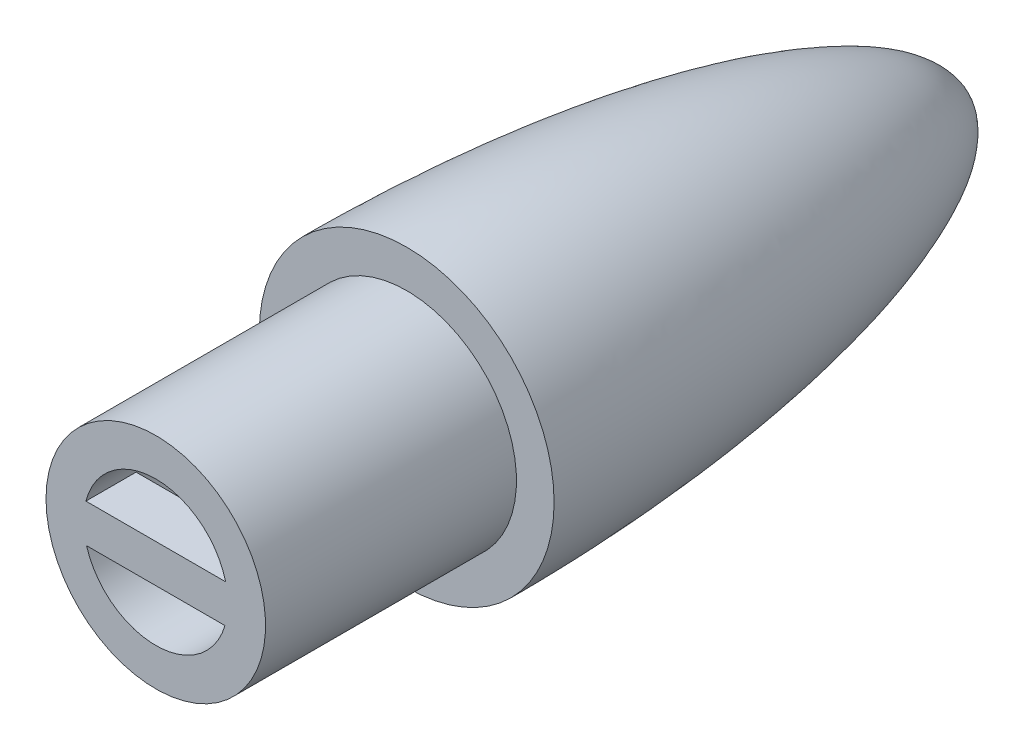
ISO-10303-21;
HEADER;
FILE_DESCRIPTION(('STEP AP214'),'2;1');
FILE_NAME('part.step','',(''),(''),'','','');
FILE_SCHEMA(('AUTOMOTIVE_DESIGN { 1 0 10303 214 1 1 1 1 }'));
ENDSEC;
DATA;
#1=APPLICATION_CONTEXT('core data for automotive mechanical design processes');
#2=APPLICATION_PROTOCOL_DEFINITION('international standard','automotive_design',2000,#1);
#3=PRODUCT_CONTEXT('',#1,'mechanical');
#4=PRODUCT('Part','Part','',(#3));
#5=PRODUCT_RELATED_PRODUCT_CATEGORY('part','',(#4));
#6=PRODUCT_DEFINITION_FORMATION('','',#4);
#7=PRODUCT_DEFINITION_CONTEXT('part definition',#1,'design');
#8=PRODUCT_DEFINITION('design','',#6,#7);
#9=PRODUCT_DEFINITION_SHAPE('','',#8);
#10=(LENGTH_UNIT() NAMED_UNIT(*) SI_UNIT(.MILLI.,.METRE.));
#11=(NAMED_UNIT(*) PLANE_ANGLE_UNIT() SI_UNIT($,.RADIAN.));
#12=(NAMED_UNIT(*) SI_UNIT($,.STERADIAN.) SOLID_ANGLE_UNIT());
#13=UNCERTAINTY_MEASURE_WITH_UNIT(LENGTH_MEASURE(1.E-05),#10,'distance_accuracy_value','');
#14=(GEOMETRIC_REPRESENTATION_CONTEXT(3) GLOBAL_UNCERTAINTY_ASSIGNED_CONTEXT((#13)) GLOBAL_UNIT_ASSIGNED_CONTEXT((#10,
#11,#12)) REPRESENTATION_CONTEXT('',''));
#15=CARTESIAN_POINT('',(0.,0.,0.));
#16=DIRECTION('',(0.,0.,1.));
#17=DIRECTION('',(1.,0.,0.));
#18=AXIS2_PLACEMENT_3D('',#15,#16,#17);
#19=CARTESIAN_POINT('',(0.,0.,-11.4224137931035));
#20=CARTESIAN_POINT('',(-1.27842358805768,0.,-11.4170262447102));
#21=CARTESIAN_POINT('',(-3.8731442444061,0.,-9.55869532675215));
#22=CARTESIAN_POINT('',(-5.9447869689709,0.,-5.62724240177955));
#23=CARTESIAN_POINT('',(-7.71087362541216,0.,-0.90591060847866));
#24=CARTESIAN_POINT('',(-8.88561835909065,0.,3.57028401284876));
#25=CARTESIAN_POINT('',(-9.89139584509542,0.,8.5945616289192));
#26=CARTESIAN_POINT('',(-10.6704832252647,0.,13.7917627413052));
#27=CARTESIAN_POINT('',(-11.21901277394,0.,19.1220090952529));
#28=CARTESIAN_POINT('',(-11.5302376957972,0.,23.7906689026005));
#29=CARTESIAN_POINT('',(-11.7075213881395,0.,28.0932945242523));
#30=CARTESIAN_POINT('',(-11.7499661768627,0.,30.9224469636252));
#31=CARTESIAN_POINT('',(-11.75,0.,32.5775862068965));
#32=B_SPLINE_CURVE_WITH_KNOTS('',3,(#19,#20,#21,#22,#23,#24,#25,#26,#27,#28,#29,#30,#31),
.UNSPECIFIED.,.F.,.F.,(4,1,1,1,1,1,1,1,1,1,4),(0.,0.0770957447788934,0.191082865444481,
0.276022469991274,0.39603374384951,0.482752955144431,0.599802604730606,0.727919368573412,
0.821235279188653,0.895416593572724,1.),.UNSPECIFIED.);
#33=CARTESIAN_POINT('',(0.,0.,-11.4224137931035));
#34=DIRECTION('',(0.,0.,-1.));
#35=AXIS1_PLACEMENT('',#33,#34);
#36=SURFACE_OF_REVOLUTION('',#32,#35);
#37=CARTESIAN_POINT('',(0.,0.,32.5775862068965));
#38=DIRECTION('',(0.,0.,-1.));
#39=DIRECTION('',(-1.,0.,0.));
#40=AXIS2_PLACEMENT_3D('',#37,#38,#39);
#41=CIRCLE('',#40,11.75);
#42=CARTESIAN_POINT('',(-11.75,0.,32.5775862068965));
#43=VERTEX_POINT('',#42);
#44=EDGE_CURVE('E151',#43,#43,#41,.T.);
#45=ORIENTED_EDGE('',*,*,#44,.T.);
#46=EDGE_LOOP('',(#45));
#47=FACE_BOUND('',#46,.T.);
#48=CARTESIAN_POINT('',(0.,0.,-11.4224137931035));
#49=VERTEX_POINT('',#48);
#50=VERTEX_LOOP('',#49);
#51=FACE_BOUND('',#50,.T.);
#52=ADVANCED_FACE('F39',(#47,#51),#36,.F.);
#53=CARTESIAN_POINT('',(0.,0.,1.94358481155403));
#54=DIRECTION('',(0.,0.,1.));
#55=DIRECTION('',(1.,0.,0.));
#56=AXIS2_PLACEMENT_3D('',#53,#54,#55);
#57=CONICAL_SURFACE('',#56,6.03426066556403,0.506929341075671);
#58=CARTESIAN_POINT('',(0.,0.,-8.92241379310346));
#59=VERTEX_POINT('',#58);
#60=VERTEX_LOOP('',#59);
#61=FACE_BOUND('',#60,.T.);
#62=CARTESIAN_POINT('',(0.,0.,1.94358481155403));
#63=DIRECTION('',(0.,0.,-1.));
#64=DIRECTION('',(-1.,0.,0.));
#65=AXIS2_PLACEMENT_3D('',#62,#63,#64);
#66=CIRCLE('',#65,6.03426066556403);
#67=CARTESIAN_POINT('',(-6.03426066556403,0.,1.94358481155403));
#68=VERTEX_POINT('',#67);
#69=EDGE_CURVE('E123',#68,#68,#66,.T.);
#70=ORIENTED_EDGE('',*,*,#69,.F.);
#71=EDGE_LOOP('',(#70));
#72=FACE_BOUND('',#71,.T.);
#73=ADVANCED_FACE('F179',(#61,#72),#57,.F.);
#74=CARTESIAN_POINT('',(0.,0.,29.5775862068965));
#75=DIRECTION('',(0.,0.,1.));
#76=DIRECTION('',(1.,0.,0.));
#77=AXIS2_PLACEMENT_3D('',#74,#75,#76);
#78=CONICAL_SURFACE('',#77,8.74999999999999,0.0979607228679892);
#79=ORIENTED_EDGE('',*,*,#69,.T.);
#80=EDGE_LOOP('',(#79));
#81=FACE_BOUND('',#80,.T.);
#82=CARTESIAN_POINT('',(0.,0.,29.5775862068965));
#83=DIRECTION('',(0.,0.,-1.));
#84=DIRECTION('',(-1.,0.,0.));
#85=AXIS2_PLACEMENT_3D('',#82,#83,#84);
#86=CIRCLE('',#85,8.74999999999999);
#87=CARTESIAN_POINT('',(-8.74999999999999,0.,29.5775862068965));
#88=VERTEX_POINT('',#87);
#89=EDGE_CURVE('E120',#88,#88,#86,.T.);
#90=ORIENTED_EDGE('',*,*,#89,.F.);
#91=EDGE_LOOP('',(#90));
#92=FACE_BOUND('',#91,.T.);
#93=ADVANCED_FACE('F184',(#81,#92),#78,.F.);
#94=CARTESIAN_POINT('',(-5.74999999999999,0.,29.5775862068965));
#95=DIRECTION('',(0.,0.,-1.));
#96=DIRECTION('',(-1.,0.,0.));
#97=AXIS2_PLACEMENT_3D('',#94,#95,#96);
#98=PLANE('',#97);
#99=ORIENTED_EDGE('',*,*,#89,.T.);
#100=EDGE_LOOP('',(#99));
#101=FACE_BOUND('',#100,.T.);
#102=CARTESIAN_POINT('',(0.,0.,29.5775862068965));
#103=DIRECTION('',(0.,0.,-1.));
#104=DIRECTION('',(-1.,0.,0.));
#105=AXIS2_PLACEMENT_3D('',#102,#103,#104);
#106=CIRCLE('',#105,5.74999999999999);
#107=CARTESIAN_POINT('',(-5.74999999999999,0.,29.5775862068965));
#108=VERTEX_POINT('',#107);
#109=EDGE_CURVE('E111',#108,#108,#106,.T.);
#110=ORIENTED_EDGE('',*,*,#109,.F.);
#111=EDGE_LOOP('',(#110));
#112=FACE_BOUND('',#111,.T.);
#113=ADVANCED_FACE('F191',(#101,#112),#98,.T.);
#114=CARTESIAN_POINT('',(0.,0.,-11.4224137931035));
#115=DIRECTION('',(0.,0.,-1.));
#116=DIRECTION('',(-1.,0.,0.));
#117=AXIS2_PLACEMENT_3D('',#114,#115,#116);
#118=CYLINDRICAL_SURFACE('',#117,5.74999999999999);
#119=DIRECTION('',(0.,0.,-1.));
#120=VECTOR('',#119,1.);
#121=CARTESIAN_POINT('',(-5.56936988927004,1.42990175763656,-11.4224137931035));
#122=LINE('',#121,#120);
#123=CARTESIAN_POINT('',(-5.56936988927004,1.42990175763656,48.5775862068965));
#124=VERTEX_POINT('',#123);
#125=CARTESIAN_POINT('',(-5.56936988927004,1.42990175763656,52.5775862068965));
#126=VERTEX_POINT('',#125);
#127=EDGE_CURVE('E101',#124,#126,#122,.F.);
#128=ORIENTED_EDGE('',*,*,#127,.F.);
#129=CARTESIAN_POINT('',(0.,0.,48.5775862068965));
#130=DIRECTION('',(0.,0.,1.));
#131=DIRECTION('',(1.,0.,0.));
#132=AXIS2_PLACEMENT_3D('',#129,#130,#131);
#133=CIRCLE('',#132,5.74999999999999);
#134=CARTESIAN_POINT('',(-5.51752539460574,-1.61846023117057,48.5775862068965));
#135=VERTEX_POINT('',#134);
#136=EDGE_CURVE('E11',#124,#135,#133,.T.);
#137=ORIENTED_EDGE('',*,*,#136,.T.);
#138=DIRECTION('',(0.,0.,-1.));
#139=VECTOR('',#138,1.);
#140=CARTESIAN_POINT('',(-5.51752539460574,-1.61846023117057,-11.4224137931035));
#141=LINE('',#140,#139);
#142=CARTESIAN_POINT('',(-5.51752539460574,-1.61846023117057,52.5775862068965));
#143=VERTEX_POINT('',#142);
#144=EDGE_CURVE('E88',#143,#135,#141,.T.);
#145=ORIENTED_EDGE('',*,*,#144,.F.);
#146=CARTESIAN_POINT('',(0.,0.,52.5775862068965));
#147=DIRECTION('',(0.,0.,-1.));
#148=DIRECTION('',(-1.,0.,0.));
#149=AXIS2_PLACEMENT_3D('',#146,#147,#148);
#150=CIRCLE('',#149,5.74999999999999);
#151=CARTESIAN_POINT('',(5.51752539460574,-1.61846023117057,52.5775862068965));
#152=VERTEX_POINT('',#151);
#153=EDGE_CURVE('E99',#152,#143,#150,.T.);
#154=ORIENTED_EDGE('',*,*,#153,.F.);
#155=DIRECTION('',(0.,0.,-1.));
#156=VECTOR('',#155,1.);
#157=CARTESIAN_POINT('',(5.51752539460574,-1.61846023117057,-11.4224137931035));
#158=LINE('',#157,#156);
#159=CARTESIAN_POINT('',(5.51752539460574,-1.61846023117057,48.5775862068965));
#160=VERTEX_POINT('',#159);
#161=EDGE_CURVE('E91',#160,#152,#158,.F.);
#162=ORIENTED_EDGE('',*,*,#161,.F.);
#163=CARTESIAN_POINT('',(5.56936988927004,1.42990175763656,48.5775862068965));
#164=VERTEX_POINT('',#163);
#165=EDGE_CURVE('E43',#160,#164,#133,.T.);
#166=ORIENTED_EDGE('',*,*,#165,.T.);
#167=DIRECTION('',(0.,0.,-1.));
#168=VECTOR('',#167,1.);
#169=CARTESIAN_POINT('',(5.56936988927004,1.42990175763656,-11.4224137931035));
#170=LINE('',#169,#168);
#171=CARTESIAN_POINT('',(5.56936988927004,1.42990175763656,52.5775862068965));
#172=VERTEX_POINT('',#171);
#173=EDGE_CURVE('E132',#172,#164,#170,.T.);
#174=ORIENTED_EDGE('',*,*,#173,.F.);
#175=EDGE_CURVE('E106',#126,#172,#150,.T.);
#176=ORIENTED_EDGE('',*,*,#175,.F.);
#177=EDGE_LOOP('',(#128,#137,#145,#154,#162,#166,#174,#176));
#178=FACE_BOUND('',#177,.T.);
#179=ORIENTED_EDGE('',*,*,#109,.T.);
#180=EDGE_LOOP('',(#179));
#181=FACE_BOUND('',#180,.T.);
#182=ADVANCED_FACE('F97',(#178,#181),#118,.F.);
#183=CARTESIAN_POINT('',(-8.74999999999999,0.,52.5775862068965));
#184=DIRECTION('',(0.,0.,1.));
#185=DIRECTION('',(1.,0.,0.));
#186=AXIS2_PLACEMENT_3D('',#183,#184,#185);
#187=PLANE('',#186);
#188=DIRECTION('',(-1.,0.,0.));
#189=VECTOR('',#188,1.);
#190=CARTESIAN_POINT('',(-6.53669374919466,1.42990175763656,52.5775862068965));
#191=LINE('',#190,#189);
#192=EDGE_CURVE('E61',#172,#126,#191,.T.);
#193=ORIENTED_EDGE('',*,*,#192,.T.);
#194=ORIENTED_EDGE('',*,*,#175,.T.);
#195=EDGE_LOOP('',(#193,#194));
#196=FACE_BOUND('',#195,.T.);
#197=ORIENTED_EDGE('',*,*,#153,.T.);
#198=DIRECTION('',(1.,0.,0.));
#199=VECTOR('',#198,1.);
#200=CARTESIAN_POINT('',(-6.53669374919466,-1.61846023117057,52.5775862068965));
#201=LINE('',#200,#199);
#202=EDGE_CURVE('E54',#143,#152,#201,.T.);
#203=ORIENTED_EDGE('',*,*,#202,.T.);
#204=EDGE_LOOP('',(#197,#203));
#205=FACE_BOUND('',#204,.T.);
#206=CARTESIAN_POINT('',(0.,0.,52.5775862068965));
#207=DIRECTION('',(0.,0.,-1.));
#208=DIRECTION('',(-1.,0.,0.));
#209=AXIS2_PLACEMENT_3D('',#206,#207,#208);
#210=CIRCLE('',#209,8.74999999999999);
#211=CARTESIAN_POINT('',(-8.74999999999999,0.,52.5775862068965));
#212=VERTEX_POINT('',#211);
#213=EDGE_CURVE('E107',#212,#212,#210,.T.);
#214=ORIENTED_EDGE('',*,*,#213,.F.);
#215=EDGE_LOOP('',(#214));
#216=FACE_BOUND('',#215,.T.);
#217=ADVANCED_FACE('F103',(#196,#205,#216),#187,.T.);
#218=CARTESIAN_POINT('',(0.,0.,-11.4224137931035));
#219=DIRECTION('',(0.,0.,-1.));
#220=DIRECTION('',(-1.,0.,0.));
#221=AXIS2_PLACEMENT_3D('',#218,#219,#220);
#222=CYLINDRICAL_SURFACE('',#221,8.74999999999999);
#223=ORIENTED_EDGE('',*,*,#213,.T.);
#224=EDGE_LOOP('',(#223));
#225=FACE_BOUND('',#224,.T.);
#226=CARTESIAN_POINT('',(0.,0.,32.5775862068965));
#227=DIRECTION('',(0.,0.,-1.));
#228=DIRECTION('',(-1.,0.,0.));
#229=AXIS2_PLACEMENT_3D('',#226,#227,#228);
#230=CIRCLE('',#229,8.74999999999999);
#231=CARTESIAN_POINT('',(-8.74999999999999,0.,32.5775862068965));
#232=VERTEX_POINT('',#231);
#233=EDGE_CURVE('E113',#232,#232,#230,.T.);
#234=ORIENTED_EDGE('',*,*,#233,.F.);
#235=EDGE_LOOP('',(#234));
#236=FACE_BOUND('',#235,.T.);
#237=ADVANCED_FACE('F168',(#225,#236),#222,.T.);
#238=CARTESIAN_POINT('',(-11.75,0.,32.5775862068965));
#239=DIRECTION('',(0.,0.,1.));
#240=DIRECTION('',(1.,0.,0.));
#241=AXIS2_PLACEMENT_3D('',#238,#239,#240);
#242=PLANE('',#241);
#243=ORIENTED_EDGE('',*,*,#233,.T.);
#244=EDGE_LOOP('',(#243));
#245=FACE_BOUND('',#244,.T.);
#246=ORIENTED_EDGE('',*,*,#44,.F.);
#247=EDGE_LOOP('',(#246));
#248=FACE_BOUND('',#247,.T.);
#249=ADVANCED_FACE('F165',(#245,#248),#242,.T.);
#250=CARTESIAN_POINT('',(0.,0.,48.5775862068965));
#251=DIRECTION('',(0.,0.,1.));
#252=DIRECTION('',(1.,0.,0.));
#253=AXIS2_PLACEMENT_3D('',#250,#251,#252);
#254=PLANE('',#253);
#255=ORIENTED_EDGE('',*,*,#136,.F.);
#256=DIRECTION('',(-1.,0.,0.));
#257=VECTOR('',#256,1.);
#258=CARTESIAN_POINT('',(-6.53669374919466,1.42990175763656,48.5775862068965));
#259=LINE('',#258,#257);
#260=EDGE_CURVE('E138',#164,#124,#259,.T.);
#261=ORIENTED_EDGE('',*,*,#260,.F.);
#262=ORIENTED_EDGE('',*,*,#165,.F.);
#263=DIRECTION('',(1.,0.,0.));
#264=VECTOR('',#263,1.);
#265=CARTESIAN_POINT('',(-6.53669374919466,-1.61846023117057,48.5775862068965));
#266=LINE('',#265,#264);
#267=EDGE_CURVE('E136',#135,#160,#266,.T.);
#268=ORIENTED_EDGE('',*,*,#267,.F.);
#269=EDGE_LOOP('',(#255,#261,#262,#268));
#270=FACE_BOUND('',#269,.T.);
#271=ADVANCED_FACE('F135',(#270),#254,.F.);
#272=CARTESIAN_POINT('',(-6.53669374919466,1.42990175763656,48.5775862068965));
#273=DIRECTION('',(0.,1.,0.));
#274=DIRECTION('',(0.,0.,1.));
#275=AXIS2_PLACEMENT_3D('',#272,#273,#274);
#276=PLANE('',#275);
#277=ORIENTED_EDGE('',*,*,#192,.F.);
#278=ORIENTED_EDGE('',*,*,#173,.T.);
#279=ORIENTED_EDGE('',*,*,#260,.T.);
#280=ORIENTED_EDGE('',*,*,#127,.T.);
#281=EDGE_LOOP('',(#277,#278,#279,#280));
#282=FACE_BOUND('',#281,.T.);
#283=ADVANCED_FACE('F219',(#282),#276,.T.);
#284=CARTESIAN_POINT('',(-6.53669374919466,-1.61846023117057,48.5775862068965));
#285=DIRECTION('',(0.,-1.,0.));
#286=DIRECTION('',(0.,0.,-1.));
#287=AXIS2_PLACEMENT_3D('',#284,#285,#286);
#288=PLANE('',#287);
#289=ORIENTED_EDGE('',*,*,#202,.F.);
#290=ORIENTED_EDGE('',*,*,#144,.T.);
#291=ORIENTED_EDGE('',*,*,#267,.T.);
#292=ORIENTED_EDGE('',*,*,#161,.T.);
#293=EDGE_LOOP('',(#289,#290,#291,#292));
#294=FACE_BOUND('',#293,.T.);
#295=ADVANCED_FACE('F86',(#294),#288,.T.);
#296=CLOSED_SHELL('',(#52,#73,#93,#113,#182,#217,#237,#249,#271,#283,#295));
#297=MANIFOLD_SOLID_BREP('B2',#296);
#298=ADVANCED_BREP_SHAPE_REPRESENTATION('',(#18,#297),#14);
#299=SHAPE_DEFINITION_REPRESENTATION(#9,#298);
ENDSEC;
END-ISO-10303-21;
